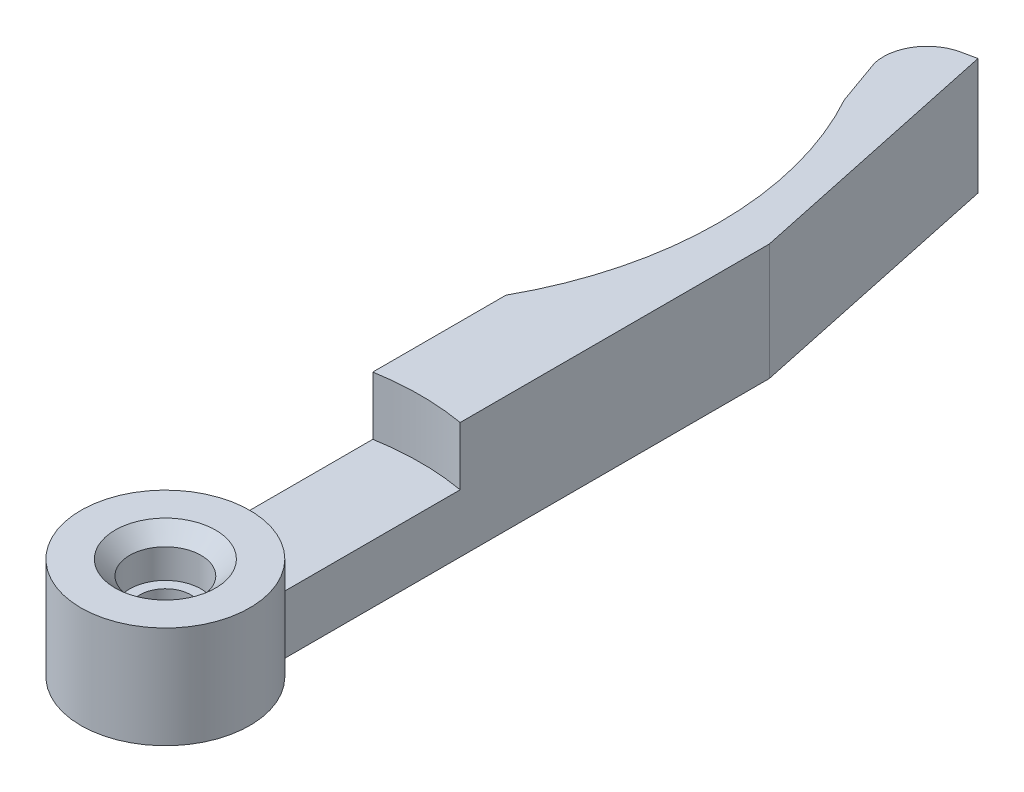
ISO-10303-21;
HEADER;
FILE_DESCRIPTION(('STEP AP214'),'2;1');
FILE_NAME('part.step','',(''),(''),'','','');
FILE_SCHEMA(('AUTOMOTIVE_DESIGN { 1 0 10303 214 1 1 1 1 }'));
ENDSEC;
DATA;
#1=APPLICATION_CONTEXT('core data for automotive mechanical design processes');
#2=APPLICATION_PROTOCOL_DEFINITION('international standard','automotive_design',2000,#1);
#3=PRODUCT_CONTEXT('',#1,'mechanical');
#4=PRODUCT('Part','Part','',(#3));
#5=PRODUCT_RELATED_PRODUCT_CATEGORY('part','',(#4));
#6=PRODUCT_DEFINITION_FORMATION('','',#4);
#7=PRODUCT_DEFINITION_CONTEXT('part definition',#1,'design');
#8=PRODUCT_DEFINITION('design','',#6,#7);
#9=PRODUCT_DEFINITION_SHAPE('','',#8);
#10=(LENGTH_UNIT() NAMED_UNIT(*) SI_UNIT(.MILLI.,.METRE.));
#11=(NAMED_UNIT(*) PLANE_ANGLE_UNIT() SI_UNIT($,.RADIAN.));
#12=(NAMED_UNIT(*) SI_UNIT($,.STERADIAN.) SOLID_ANGLE_UNIT());
#13=UNCERTAINTY_MEASURE_WITH_UNIT(LENGTH_MEASURE(1.E-05),#10,'distance_accuracy_value','');
#14=(GEOMETRIC_REPRESENTATION_CONTEXT(3) GLOBAL_UNCERTAINTY_ASSIGNED_CONTEXT((#13)) GLOBAL_UNIT_ASSIGNED_CONTEXT((#10,
#11,#12)) REPRESENTATION_CONTEXT('',''));
#15=CARTESIAN_POINT('',(0.,0.,0.));
#16=DIRECTION('',(0.,0.,1.));
#17=DIRECTION('',(1.,0.,0.));
#18=AXIS2_PLACEMENT_3D('',#15,#16,#17);
#19=CARTESIAN_POINT('',(0.,8.,0.));
#20=DIRECTION('',(0.,-1.,0.));
#21=DIRECTION('',(0.,0.,-1.));
#22=AXIS2_PLACEMENT_3D('',#19,#20,#21);
#23=CYLINDRICAL_SURFACE('',#22,5.8);
#24=DIRECTION('',(0.,-1.,0.));
#25=VECTOR('',#24,1.);
#26=CARTESIAN_POINT('',(2.99999999999999,8.,-4.96386945839635));
#27=LINE('',#26,#25);
#28=CARTESIAN_POINT('',(2.99999999999999,4.,-4.96386945839635));
#29=VERTEX_POINT('',#28);
#30=CARTESIAN_POINT('',(2.99999999999999,0.,-4.96386945839635));
#31=VERTEX_POINT('',#30);
#32=EDGE_CURVE('E176',#29,#31,#27,.T.);
#33=ORIENTED_EDGE('',*,*,#32,.F.);
#34=CARTESIAN_POINT('',(0.,4.,0.));
#35=DIRECTION('',(0.,-1.,0.));
#36=DIRECTION('',(0.,0.,-1.));
#37=AXIS2_PLACEMENT_3D('',#34,#35,#36);
#38=CIRCLE('',#37,5.80000000000002);
#39=CARTESIAN_POINT('',(-2.99999999999999,4.,-4.96386945839635));
#40=VERTEX_POINT('',#39);
#41=EDGE_CURVE('E263',#40,#29,#38,.T.);
#42=ORIENTED_EDGE('',*,*,#41,.F.);
#43=DIRECTION('',(0.,-1.,0.));
#44=VECTOR('',#43,1.);
#45=CARTESIAN_POINT('',(-2.99999999999999,8.,-4.96386945839635));
#46=LINE('',#45,#44);
#47=CARTESIAN_POINT('',(-2.99999999999999,0.,-4.96386945839635));
#48=VERTEX_POINT('',#47);
#49=EDGE_CURVE('E100',#40,#48,#46,.T.);
#50=ORIENTED_EDGE('',*,*,#49,.T.);
#51=CARTESIAN_POINT('',(0.,0.,0.));
#52=DIRECTION('',(0.,1.,0.));
#53=DIRECTION('',(0.,0.,1.));
#54=AXIS2_PLACEMENT_3D('',#51,#52,#53);
#55=CIRCLE('',#54,5.8);
#56=EDGE_CURVE('E148',#48,#31,#55,.T.);
#57=ORIENTED_EDGE('',*,*,#56,.T.);
#58=EDGE_LOOP('',(#33,#42,#50,#57));
#59=FACE_BOUND('',#58,.T.);
#60=CARTESIAN_POINT('',(0.,7.,0.));
#61=DIRECTION('',(0.,1.,0.));
#62=DIRECTION('',(0.,0.,1.));
#63=AXIS2_PLACEMENT_3D('',#60,#61,#62);
#64=CIRCLE('',#63,5.8);
#65=CARTESIAN_POINT('',(0.,7.,5.8));
#66=VERTEX_POINT('',#65);
#67=EDGE_CURVE('E302',#66,#66,#64,.T.);
#68=ORIENTED_EDGE('',*,*,#67,.F.);
#69=EDGE_LOOP('',(#68));
#70=FACE_BOUND('',#69,.T.);
#71=ADVANCED_FACE('F41',(#59,#70),#23,.T.);
#72=CARTESIAN_POINT('',(0.,4.,0.));
#73=DIRECTION('',(0.,1.,0.));
#74=DIRECTION('',(0.,0.,1.));
#75=AXIS2_PLACEMENT_3D('',#72,#73,#74);
#76=CYLINDRICAL_SURFACE('',#75,2.45);
#77=CARTESIAN_POINT('',(0.,5.99999999999999,0.));
#78=DIRECTION('',(0.,1.,0.));
#79=DIRECTION('',(0.,0.,1.));
#80=AXIS2_PLACEMENT_3D('',#77,#78,#79);
#81=CIRCLE('',#80,2.45);
#82=CARTESIAN_POINT('',(0.,5.99999999999999,2.45000000000002));
#83=VERTEX_POINT('',#82);
#84=EDGE_CURVE('E11',#83,#83,#81,.T.);
#85=ORIENTED_EDGE('',*,*,#84,.T.);
#86=EDGE_LOOP('',(#85));
#87=FACE_BOUND('',#86,.T.);
#88=CARTESIAN_POINT('',(0.,4.,0.));
#89=DIRECTION('',(0.,1.,0.));
#90=DIRECTION('',(0.,0.,1.));
#91=AXIS2_PLACEMENT_3D('',#88,#89,#90);
#92=CIRCLE('',#91,2.45);
#93=CARTESIAN_POINT('',(0.,4.,2.45000000000002));
#94=VERTEX_POINT('',#93);
#95=EDGE_CURVE('E151',#94,#94,#92,.T.);
#96=ORIENTED_EDGE('',*,*,#95,.F.);
#97=EDGE_LOOP('',(#96));
#98=FACE_BOUND('',#97,.T.);
#99=ADVANCED_FACE('F197',(#87,#98),#76,.F.);
#100=CARTESIAN_POINT('',(0.,-0.00100000000000013,0.));
#101=DIRECTION('',(0.,1.,0.));
#102=DIRECTION('',(0.,0.,1.));
#103=AXIS2_PLACEMENT_3D('',#100,#101,#102);
#104=CYLINDRICAL_SURFACE('',#103,1.75);
#105=CARTESIAN_POINT('',(0.,4.,0.));
#106=DIRECTION('',(0.,1.,0.));
#107=DIRECTION('',(0.,0.,1.));
#108=AXIS2_PLACEMENT_3D('',#105,#106,#107);
#109=CIRCLE('',#108,1.75);
#110=CARTESIAN_POINT('',(0.,4.,1.75000000000002));
#111=VERTEX_POINT('',#110);
#112=EDGE_CURVE('E180',#111,#111,#109,.T.);
#113=ORIENTED_EDGE('',*,*,#112,.T.);
#114=EDGE_LOOP('',(#113));
#115=FACE_BOUND('',#114,.T.);
#116=CARTESIAN_POINT('',(0.,2.5,0.));
#117=DIRECTION('',(0.,-1.,0.));
#118=DIRECTION('',(0.,0.,-1.));
#119=AXIS2_PLACEMENT_3D('',#116,#117,#118);
#120=CIRCLE('',#119,1.75);
#121=CARTESIAN_POINT('',(0.,2.5,-1.74999999999998));
#122=VERTEX_POINT('',#121);
#123=EDGE_CURVE('E178',#122,#122,#120,.F.);
#124=ORIENTED_EDGE('',*,*,#123,.F.);
#125=EDGE_LOOP('',(#124));
#126=FACE_BOUND('',#125,.T.);
#127=ADVANCED_FACE('F201',(#115,#126),#104,.F.);
#128=CARTESIAN_POINT('',(3.,8.,-38.4638694583963));
#129=DIRECTION('',(-1.,0.,0.));
#130=DIRECTION('',(0.,0.,1.));
#131=AXIS2_PLACEMENT_3D('',#128,#129,#130);
#132=PLANE('',#131);
#133=DIRECTION('',(0.,0.,-1.));
#134=VECTOR('',#133,1.);
#135=CARTESIAN_POINT('',(3.,8.,-38.4638694583963));
#136=LINE('',#135,#134);
#137=CARTESIAN_POINT('',(3.,8.,-17.2409396495667));
#138=VERTEX_POINT('',#137);
#139=CARTESIAN_POINT('',(3.,8.,-38.4638694583963));
#140=VERTEX_POINT('',#139);
#141=EDGE_CURVE('E107',#138,#140,#136,.T.);
#142=ORIENTED_EDGE('',*,*,#141,.F.);
#143=DIRECTION('',(0.,1.,0.));
#144=VECTOR('',#143,1.);
#145=CARTESIAN_POINT('',(2.99999999999999,4.,-17.2409396495667));
#146=LINE('',#145,#144);
#147=CARTESIAN_POINT('',(2.99999999999999,4.,-17.2409396495667));
#148=VERTEX_POINT('',#147);
#149=EDGE_CURVE('E57',#148,#138,#146,.T.);
#150=ORIENTED_EDGE('',*,*,#149,.F.);
#151=DIRECTION('',(0.,0.,-1.));
#152=VECTOR('',#151,1.);
#153=CARTESIAN_POINT('',(2.99999999999999,4.,-4.96386945839635));
#154=LINE('',#153,#152);
#155=EDGE_CURVE('E267',#29,#148,#154,.T.);
#156=ORIENTED_EDGE('',*,*,#155,.F.);
#157=ORIENTED_EDGE('',*,*,#32,.T.);
#158=DIRECTION('',(0.,0.,-1.));
#159=VECTOR('',#158,1.);
#160=CARTESIAN_POINT('',(3.,0.,-38.4638694583963));
#161=LINE('',#160,#159);
#162=CARTESIAN_POINT('',(3.,0.,-38.4638694583963));
#163=VERTEX_POINT('',#162);
#164=EDGE_CURVE('E150',#31,#163,#161,.T.);
#165=ORIENTED_EDGE('',*,*,#164,.T.);
#166=DIRECTION('',(0.,-1.,0.));
#167=VECTOR('',#166,1.);
#168=CARTESIAN_POINT('',(3.,8.,-38.4638694583963));
#169=LINE('',#168,#167);
#170=EDGE_CURVE('E173',#140,#163,#169,.T.);
#171=ORIENTED_EDGE('',*,*,#170,.F.);
#172=EDGE_LOOP('',(#142,#150,#156,#157,#165,#171));
#173=FACE_BOUND('',#172,.T.);
#174=ADVANCED_FACE('F207',(#173),#132,.F.);
#175=CARTESIAN_POINT('',(-0.867157449210331,8.,-56.6574148320451));
#176=DIRECTION('',(-0.978147600733806,0.,0.20791169081776));
#177=DIRECTION('',(0.20791169081776,0.,0.978147600733806));
#178=AXIS2_PLACEMENT_3D('',#175,#176,#177);
#179=PLANE('',#178);
#180=DIRECTION('',(-0.20791169081776,0.,-0.978147600733805));
#181=VECTOR('',#180,1.);
#182=CARTESIAN_POINT('',(-0.867157449210331,0.,-56.6574148320451));
#183=LINE('',#182,#181);
#184=CARTESIAN_POINT('',(-0.867157449210331,0.,-56.6574148320451));
#185=VERTEX_POINT('',#184);
#186=EDGE_CURVE('E153',#163,#185,#183,.T.);
#187=ORIENTED_EDGE('',*,*,#186,.T.);
#188=DIRECTION('',(0.,-1.,0.));
#189=VECTOR('',#188,1.);
#190=CARTESIAN_POINT('',(-0.867157449210331,8.,-56.6574148320451));
#191=LINE('',#190,#189);
#192=CARTESIAN_POINT('',(-0.867157449210331,8.,-56.6574148320451));
#193=VERTEX_POINT('',#192);
#194=EDGE_CURVE('E170',#193,#185,#191,.T.);
#195=ORIENTED_EDGE('',*,*,#194,.F.);
#196=DIRECTION('',(-0.20791169081776,0.,-0.978147600733805));
#197=VECTOR('',#196,1.);
#198=CARTESIAN_POINT('',(-0.867157449210331,8.,-56.6574148320451));
#199=LINE('',#198,#197);
#200=EDGE_CURVE('E284',#140,#193,#199,.T.);
#201=ORIENTED_EDGE('',*,*,#200,.F.);
#202=ORIENTED_EDGE('',*,*,#170,.T.);
#203=EDGE_LOOP('',(#187,#195,#201,#202));
#204=FACE_BOUND('',#203,.T.);
#205=ADVANCED_FACE('F210',(#204),#179,.F.);
#206=CARTESIAN_POINT('',(-1.84530504994414,8.,-56.4495031412274));
#207=DIRECTION('',(0.207911690817762,0.,0.978147600733805));
#208=DIRECTION('',(0.978147600733805,0.,-0.207911690817762));
#209=AXIS2_PLACEMENT_3D('',#206,#207,#208);
#210=PLANE('',#209);
#211=DIRECTION('',(-0.978147600733805,0.,0.207911690817762));
#212=VECTOR('',#211,1.);
#213=CARTESIAN_POINT('',(-1.84530504994414,0.,-56.4495031412274));
#214=LINE('',#213,#212);
#215=CARTESIAN_POINT('',(-1.84530504994414,0.,-56.4495031412274));
#216=VERTEX_POINT('',#215);
#217=EDGE_CURVE('E155',#185,#216,#214,.T.);
#218=ORIENTED_EDGE('',*,*,#217,.T.);
#219=DIRECTION('',(0.,-1.,0.));
#220=VECTOR('',#219,1.);
#221=CARTESIAN_POINT('',(-1.84530504994414,8.,-56.4495031412274));
#222=LINE('',#221,#220);
#223=CARTESIAN_POINT('',(-1.84530504994414,8.,-56.4495031412274));
#224=VERTEX_POINT('',#223);
#225=EDGE_CURVE('E137',#224,#216,#222,.T.);
#226=ORIENTED_EDGE('',*,*,#225,.F.);
#227=DIRECTION('',(-0.978147600733805,0.,0.207911690817762));
#228=VECTOR('',#227,1.);
#229=CARTESIAN_POINT('',(-1.84530504994414,8.,-56.4495031412274));
#230=LINE('',#229,#228);
#231=EDGE_CURVE('E125',#193,#224,#230,.T.);
#232=ORIENTED_EDGE('',*,*,#231,.F.);
#233=ORIENTED_EDGE('',*,*,#194,.T.);
#234=EDGE_LOOP('',(#218,#226,#232,#233));
#235=FACE_BOUND('',#234,.T.);
#236=ADVANCED_FACE('F214',(#235),#210,.F.);
#237=CARTESIAN_POINT('',(-1.22156997749086,8.,-53.515060339026));
#238=DIRECTION('',(0.,-1.,0.));
#239=DIRECTION('',(0.,0.,-1.));
#240=AXIS2_PLACEMENT_3D('',#237,#238,#239);
#241=CYLINDRICAL_SURFACE('',#240,3.);
#242=CARTESIAN_POINT('',(-1.22156997749086,0.,-53.515060339026));
#243=DIRECTION('',(0.,1.,0.));
#244=DIRECTION('',(0.,0.,-1.));
#245=AXIS2_PLACEMENT_3D('',#242,#243,#244);
#246=CIRCLE('',#245,3.);
#247=CARTESIAN_POINT('',(-4.14041417555798,0.,-52.8219885192194));
#248=VERTEX_POINT('',#247);
#249=EDGE_CURVE('E134',#216,#248,#246,.T.);
#250=ORIENTED_EDGE('',*,*,#249,.T.);
#251=DIRECTION('',(0.,-1.,0.));
#252=VECTOR('',#251,1.);
#253=CARTESIAN_POINT('',(-4.14041417555798,8.,-52.8219885192194));
#254=LINE('',#253,#252);
#255=CARTESIAN_POINT('',(-4.14041417555798,8.,-52.8219885192194));
#256=VERTEX_POINT('',#255);
#257=EDGE_CURVE('E131',#256,#248,#254,.T.);
#258=ORIENTED_EDGE('',*,*,#257,.F.);
#259=CARTESIAN_POINT('',(-1.22156997749086,8.,-53.515060339026));
#260=DIRECTION('',(0.,1.,0.));
#261=DIRECTION('',(0.,0.,-1.));
#262=AXIS2_PLACEMENT_3D('',#259,#260,#261);
#263=CIRCLE('',#262,3.);
#264=EDGE_CURVE('E118',#224,#256,#263,.T.);
#265=ORIENTED_EDGE('',*,*,#264,.F.);
#266=ORIENTED_EDGE('',*,*,#225,.T.);
#267=EDGE_LOOP('',(#250,#258,#265,#266));
#268=FACE_BOUND('',#267,.T.);
#269=ADVANCED_FACE('F132',(#268),#241,.T.);
#270=CARTESIAN_POINT('',(-4.14041417555798,8.,-52.8219885192194));
#271=DIRECTION('',(0.942070141352118,0.,-0.33541593398764));
#272=DIRECTION('',(-0.33541593398764,0.,-0.942070141352118));
#273=AXIS2_PLACEMENT_3D('',#270,#271,#272);
#274=PLANE('',#273);
#275=DIRECTION('',(0.33541593398764,0.,0.942070141352118));
#276=VECTOR('',#275,1.);
#277=CARTESIAN_POINT('',(-4.14041417555798,0.,-52.8219885192194));
#278=LINE('',#277,#276);
#279=CARTESIAN_POINT('',(-3.,0.,-49.6189500386222));
#280=VERTEX_POINT('',#279);
#281=EDGE_CURVE('E158',#248,#280,#278,.T.);
#282=ORIENTED_EDGE('',*,*,#281,.T.);
#283=DIRECTION('',(0.,-1.,0.));
#284=VECTOR('',#283,1.);
#285=CARTESIAN_POINT('',(-3.,8.,-49.6189500386222));
#286=LINE('',#285,#284);
#287=CARTESIAN_POINT('',(-3.,8.,-49.6189500386222));
#288=VERTEX_POINT('',#287);
#289=EDGE_CURVE('E138',#288,#280,#286,.T.);
#290=ORIENTED_EDGE('',*,*,#289,.F.);
#291=DIRECTION('',(0.33541593398764,0.,0.942070141352118));
#292=VECTOR('',#291,1.);
#293=CARTESIAN_POINT('',(-4.14041417555798,8.,-52.8219885192194));
#294=LINE('',#293,#292);
#295=EDGE_CURVE('E122',#256,#288,#294,.T.);
#296=ORIENTED_EDGE('',*,*,#295,.F.);
#297=ORIENTED_EDGE('',*,*,#257,.T.);
#298=EDGE_LOOP('',(#282,#290,#296,#297));
#299=FACE_BOUND('',#298,.T.);
#300=ADVANCED_FACE('F140',(#299),#274,.F.);
#301=CARTESIAN_POINT('',(-24.,8.,-38.));
#302=DIRECTION('',(0.,-1.,0.));
#303=DIRECTION('',(0.,0.,-1.));
#304=AXIS2_PLACEMENT_3D('',#301,#302,#303);
#305=CYLINDRICAL_SURFACE('',#304,24.);
#306=CARTESIAN_POINT('',(-24.,0.,-38.));
#307=DIRECTION('',(0.,-1.,0.));
#308=DIRECTION('',(0.,0.,-1.));
#309=AXIS2_PLACEMENT_3D('',#306,#307,#308);
#310=CIRCLE('',#309,24.);
#311=CARTESIAN_POINT('',(-2.99999999999999,0.,-26.3810499613777));
#312=VERTEX_POINT('',#311);
#313=EDGE_CURVE('E160',#280,#312,#310,.T.);
#314=ORIENTED_EDGE('',*,*,#313,.T.);
#315=DIRECTION('',(0.,-1.,0.));
#316=VECTOR('',#315,1.);
#317=CARTESIAN_POINT('',(-2.99999999999999,8.,-26.3810499613777));
#318=LINE('',#317,#316);
#319=CARTESIAN_POINT('',(-2.99999999999999,8.,-26.3810499613777));
#320=VERTEX_POINT('',#319);
#321=EDGE_CURVE('E165',#320,#312,#318,.T.);
#322=ORIENTED_EDGE('',*,*,#321,.F.);
#323=CARTESIAN_POINT('',(-24.,8.,-38.));
#324=DIRECTION('',(0.,-1.,0.));
#325=DIRECTION('',(0.,0.,-1.));
#326=AXIS2_PLACEMENT_3D('',#323,#324,#325);
#327=CIRCLE('',#326,24.);
#328=EDGE_CURVE('E66',#288,#320,#327,.T.);
#329=ORIENTED_EDGE('',*,*,#328,.F.);
#330=ORIENTED_EDGE('',*,*,#289,.T.);
#331=EDGE_LOOP('',(#314,#322,#329,#330));
#332=FACE_BOUND('',#331,.T.);
#333=ADVANCED_FACE('F223',(#332),#305,.F.);
#334=CARTESIAN_POINT('',(-2.99999999999999,8.,-26.3810499613777));
#335=DIRECTION('',(1.,0.,0.));
#336=DIRECTION('',(0.,0.,-1.));
#337=AXIS2_PLACEMENT_3D('',#334,#335,#336);
#338=PLANE('',#337);
#339=DIRECTION('',(0.,0.,1.));
#340=VECTOR('',#339,1.);
#341=CARTESIAN_POINT('',(-2.99999999999999,4.,-4.96386945839635));
#342=LINE('',#341,#340);
#343=CARTESIAN_POINT('',(-2.99999999999999,4.,-17.2409396495666));
#344=VERTEX_POINT('',#343);
#345=EDGE_CURVE('E269',#344,#40,#342,.T.);
#346=ORIENTED_EDGE('',*,*,#345,.F.);
#347=DIRECTION('',(0.,1.,0.));
#348=VECTOR('',#347,1.);
#349=CARTESIAN_POINT('',(-2.99999999999999,4.,-17.2409396495666));
#350=LINE('',#349,#348);
#351=CARTESIAN_POINT('',(-2.99999999999999,8.,-17.2409396495666));
#352=VERTEX_POINT('',#351);
#353=EDGE_CURVE('E295',#344,#352,#350,.T.);
#354=ORIENTED_EDGE('',*,*,#353,.T.);
#355=DIRECTION('',(0.,0.,1.));
#356=VECTOR('',#355,1.);
#357=CARTESIAN_POINT('',(-2.99999999999999,8.,-26.3810499613777));
#358=LINE('',#357,#356);
#359=EDGE_CURVE('E143',#320,#352,#358,.T.);
#360=ORIENTED_EDGE('',*,*,#359,.F.);
#361=ORIENTED_EDGE('',*,*,#321,.T.);
#362=DIRECTION('',(0.,0.,1.));
#363=VECTOR('',#362,1.);
#364=CARTESIAN_POINT('',(-2.99999999999999,0.,-26.3810499613777));
#365=LINE('',#364,#363);
#366=EDGE_CURVE('E162',#312,#48,#365,.T.);
#367=ORIENTED_EDGE('',*,*,#366,.T.);
#368=ORIENTED_EDGE('',*,*,#49,.F.);
#369=EDGE_LOOP('',(#346,#354,#360,#361,#367,#368));
#370=FACE_BOUND('',#369,.T.);
#371=ADVANCED_FACE('F226',(#370),#338,.F.);
#372=CARTESIAN_POINT('',(0.,8.,0.));
#373=DIRECTION('',(0.,1.,0.));
#374=DIRECTION('',(0.,0.,1.));
#375=AXIS2_PLACEMENT_3D('',#372,#373,#374);
#376=PLANE('',#375);
#377=CARTESIAN_POINT('',(0.,8.,0.));
#378=DIRECTION('',(0.,1.,0.));
#379=DIRECTION('',(0.,0.,-1.));
#380=AXIS2_PLACEMENT_3D('',#377,#378,#379);
#381=CIRCLE('',#380,17.5);
#382=EDGE_CURVE('E271',#138,#352,#381,.T.);
#383=ORIENTED_EDGE('',*,*,#382,.F.);
#384=ORIENTED_EDGE('',*,*,#141,.T.);
#385=ORIENTED_EDGE('',*,*,#200,.T.);
#386=ORIENTED_EDGE('',*,*,#231,.T.);
#387=ORIENTED_EDGE('',*,*,#264,.T.);
#388=ORIENTED_EDGE('',*,*,#295,.T.);
#389=ORIENTED_EDGE('',*,*,#328,.T.);
#390=ORIENTED_EDGE('',*,*,#359,.T.);
#391=EDGE_LOOP('',(#383,#384,#385,#386,#387,#388,#389,#390));
#392=FACE_BOUND('',#391,.T.);
#393=ADVANCED_FACE('F120',(#392),#376,.T.);
#394=CARTESIAN_POINT('',(0.,0.,0.));
#395=DIRECTION('',(0.,1.,0.));
#396=DIRECTION('',(0.,0.,1.));
#397=AXIS2_PLACEMENT_3D('',#394,#395,#396);
#398=PLANE('',#397);
#399=CARTESIAN_POINT('',(0.,0.,0.));
#400=DIRECTION('',(0.,-1.,0.));
#401=DIRECTION('',(0.,0.,-1.));
#402=AXIS2_PLACEMENT_3D('',#399,#400,#401);
#403=CIRCLE('',#402,3.75);
#404=CARTESIAN_POINT('',(0.,0.,-3.74999999999998));
#405=VERTEX_POINT('',#404);
#406=EDGE_CURVE('E292',#405,#405,#403,.T.);
#407=ORIENTED_EDGE('',*,*,#406,.F.);
#408=EDGE_LOOP('',(#407));
#409=FACE_BOUND('',#408,.T.);
#410=ORIENTED_EDGE('',*,*,#56,.F.);
#411=ORIENTED_EDGE('',*,*,#366,.F.);
#412=ORIENTED_EDGE('',*,*,#313,.F.);
#413=ORIENTED_EDGE('',*,*,#281,.F.);
#414=ORIENTED_EDGE('',*,*,#249,.F.);
#415=ORIENTED_EDGE('',*,*,#217,.F.);
#416=ORIENTED_EDGE('',*,*,#186,.F.);
#417=ORIENTED_EDGE('',*,*,#164,.F.);
#418=EDGE_LOOP('',(#410,#411,#412,#413,#414,#415,#416,#417));
#419=FACE_BOUND('',#418,.T.);
#420=ADVANCED_FACE('F231',(#409,#419),#398,.F.);
#421=CARTESIAN_POINT('',(0.,4.,0.));
#422=DIRECTION('',(0.,1.,0.));
#423=DIRECTION('',(0.,0.,1.));
#424=AXIS2_PLACEMENT_3D('',#421,#422,#423);
#425=PLANE('',#424);
#426=ORIENTED_EDGE('',*,*,#112,.F.);
#427=EDGE_LOOP('',(#426));
#428=FACE_BOUND('',#427,.T.);
#429=ORIENTED_EDGE('',*,*,#95,.T.);
#430=EDGE_LOOP('',(#429));
#431=FACE_BOUND('',#430,.T.);
#432=ADVANCED_FACE('F234',(#428,#431),#425,.T.);
#433=CARTESIAN_POINT('',(0.,2.5,0.));
#434=DIRECTION('',(0.,-1.,0.));
#435=DIRECTION('',(0.,0.,-1.));
#436=AXIS2_PLACEMENT_3D('',#433,#434,#435);
#437=PLANE('',#436);
#438=CARTESIAN_POINT('',(0.,2.5,0.));
#439=DIRECTION('',(0.,-1.,0.));
#440=DIRECTION('',(0.,0.,-1.));
#441=AXIS2_PLACEMENT_3D('',#438,#439,#440);
#442=CIRCLE('',#441,3.75);
#443=CARTESIAN_POINT('',(0.,2.5,-3.74999999999998));
#444=VERTEX_POINT('',#443);
#445=EDGE_CURVE('E181',#444,#444,#442,.T.);
#446=ORIENTED_EDGE('',*,*,#445,.T.);
#447=EDGE_LOOP('',(#446));
#448=FACE_BOUND('',#447,.T.);
#449=ORIENTED_EDGE('',*,*,#123,.T.);
#450=EDGE_LOOP('',(#449));
#451=FACE_BOUND('',#450,.T.);
#452=ADVANCED_FACE('F240',(#448,#451),#437,.T.);
#453=CARTESIAN_POINT('',(0.,2.5,0.));
#454=DIRECTION('',(0.,-1.,0.));
#455=DIRECTION('',(0.,0.,-1.));
#456=AXIS2_PLACEMENT_3D('',#453,#454,#455);
#457=CYLINDRICAL_SURFACE('',#456,3.75);
#458=ORIENTED_EDGE('',*,*,#445,.F.);
#459=EDGE_LOOP('',(#458));
#460=FACE_BOUND('',#459,.T.);
#461=ORIENTED_EDGE('',*,*,#406,.T.);
#462=EDGE_LOOP('',(#461));
#463=FACE_BOUND('',#462,.T.);
#464=ADVANCED_FACE('F245',(#460,#463),#457,.F.);
#465=CARTESIAN_POINT('',(0.,4.,0.));
#466=DIRECTION('',(0.,1.,0.));
#467=DIRECTION('',(0.,0.,1.));
#468=AXIS2_PLACEMENT_3D('',#465,#466,#467);
#469=CYLINDRICAL_SURFACE('',#468,17.5);
#470=ORIENTED_EDGE('',*,*,#382,.T.);
#471=ORIENTED_EDGE('',*,*,#353,.F.);
#472=CARTESIAN_POINT('',(0.,4.,0.));
#473=DIRECTION('',(0.,1.,0.));
#474=DIRECTION('',(0.,0.,-1.));
#475=AXIS2_PLACEMENT_3D('',#472,#473,#474);
#476=CIRCLE('',#475,17.5);
#477=EDGE_CURVE('E274',#148,#344,#476,.T.);
#478=ORIENTED_EDGE('',*,*,#477,.F.);
#479=ORIENTED_EDGE('',*,*,#149,.T.);
#480=EDGE_LOOP('',(#470,#471,#478,#479));
#481=FACE_BOUND('',#480,.T.);
#482=ADVANCED_FACE('F248',(#481),#469,.F.);
#483=CARTESIAN_POINT('',(0.,4.,0.));
#484=DIRECTION('',(0.,-1.,0.));
#485=DIRECTION('',(0.,0.,-1.));
#486=AXIS2_PLACEMENT_3D('',#483,#484,#485);
#487=PLANE('',#486);
#488=ORIENTED_EDGE('',*,*,#41,.T.);
#489=ORIENTED_EDGE('',*,*,#155,.T.);
#490=ORIENTED_EDGE('',*,*,#477,.T.);
#491=ORIENTED_EDGE('',*,*,#345,.T.);
#492=EDGE_LOOP('',(#488,#489,#490,#491));
#493=FACE_BOUND('',#492,.T.);
#494=ADVANCED_FACE('F193',(#493),#487,.F.);
#495=CARTESIAN_POINT('',(0.,7.,0.));
#496=DIRECTION('',(0.,1.,0.));
#497=DIRECTION('',(0.,0.,1.));
#498=AXIS2_PLACEMENT_3D('',#495,#496,#497);
#499=PLANE('',#498);
#500=CARTESIAN_POINT('',(0.,7.,0.));
#501=DIRECTION('',(0.,1.,0.));
#502=DIRECTION('',(0.,0.,1.));
#503=AXIS2_PLACEMENT_3D('',#500,#501,#502);
#504=CIRCLE('',#503,3.45000000000001);
#505=CARTESIAN_POINT('',(0.,7.,3.45000000000003));
#506=VERTEX_POINT('',#505);
#507=EDGE_CURVE('E50',#506,#506,#504,.F.);
#508=ORIENTED_EDGE('',*,*,#507,.T.);
#509=EDGE_LOOP('',(#508));
#510=FACE_BOUND('',#509,.T.);
#511=ORIENTED_EDGE('',*,*,#67,.T.);
#512=EDGE_LOOP('',(#511));
#513=FACE_BOUND('',#512,.T.);
#514=ADVANCED_FACE('F185',(#510,#513),#499,.T.);
#515=CARTESIAN_POINT('',(0.,7.,0.));
#516=DIRECTION('',(0.,1.,0.));
#517=DIRECTION('',(0.,0.,1.));
#518=AXIS2_PLACEMENT_3D('',#515,#516,#517);
#519=CONICAL_SURFACE('',#518,3.45000000000001,0.785398163397449);
#520=ORIENTED_EDGE('',*,*,#84,.F.);
#521=EDGE_LOOP('',(#520));
#522=FACE_BOUND('',#521,.T.);
#523=ORIENTED_EDGE('',*,*,#507,.F.);
#524=EDGE_LOOP('',(#523));
#525=FACE_BOUND('',#524,.T.);
#526=ADVANCED_FACE('F44',(#522,#525),#519,.F.);
#527=CLOSED_SHELL('',(#71,#99,#127,#174,#205,#236,#269,#300,#333,#371,#393,#420,#432,#452,#464,
#482,#494,#514,#526));
#528=MANIFOLD_SOLID_BREP('B2',#527);
#529=ADVANCED_BREP_SHAPE_REPRESENTATION('',(#18,#528),#14);
#530=SHAPE_DEFINITION_REPRESENTATION(#9,#529);
ENDSEC;
END-ISO-10303-21;
